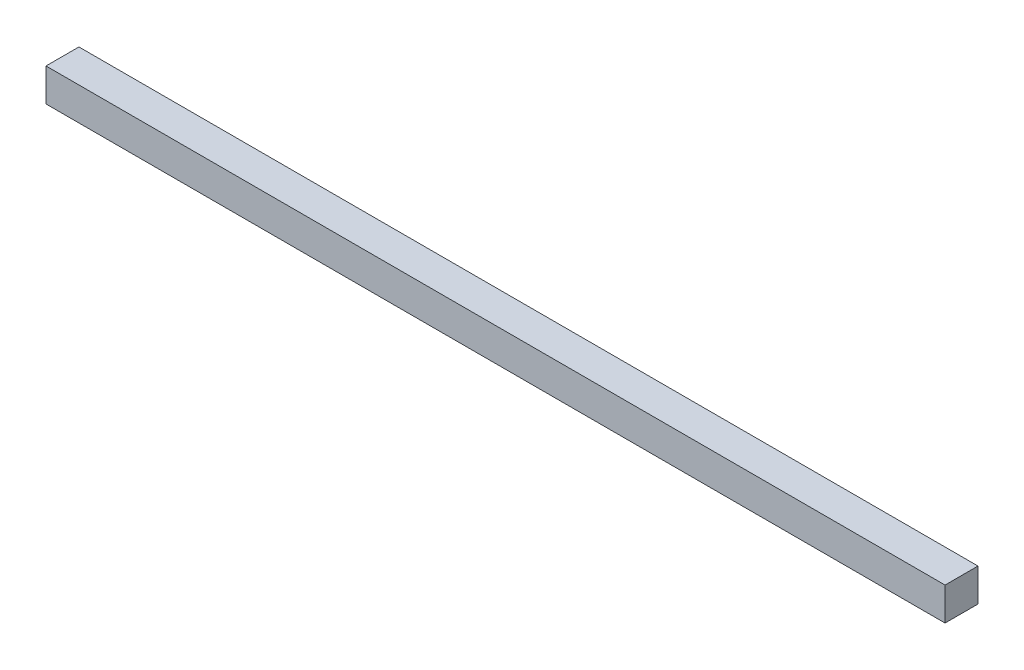
ISO-10303-21;
HEADER;
FILE_DESCRIPTION(('STEP AP214'),'2;1');
FILE_NAME('part.step','',(''),(''),'','','');
FILE_SCHEMA(('AUTOMOTIVE_DESIGN { 1 0 10303 214 1 1 1 1 }'));
ENDSEC;
DATA;
#1=APPLICATION_CONTEXT('core data for automotive mechanical design processes');
#2=APPLICATION_PROTOCOL_DEFINITION('international standard','automotive_design',2000,#1);
#3=PRODUCT_CONTEXT('',#1,'mechanical');
#4=PRODUCT('Part','Part','',(#3));
#5=PRODUCT_RELATED_PRODUCT_CATEGORY('part','',(#4));
#6=PRODUCT_DEFINITION_FORMATION('','',#4);
#7=PRODUCT_DEFINITION_CONTEXT('part definition',#1,'design');
#8=PRODUCT_DEFINITION('design','',#6,#7);
#9=PRODUCT_DEFINITION_SHAPE('','',#8);
#10=(LENGTH_UNIT() NAMED_UNIT(*) SI_UNIT(.MILLI.,.METRE.));
#11=(NAMED_UNIT(*) PLANE_ANGLE_UNIT() SI_UNIT($,.RADIAN.));
#12=(NAMED_UNIT(*) SI_UNIT($,.STERADIAN.) SOLID_ANGLE_UNIT());
#13=UNCERTAINTY_MEASURE_WITH_UNIT(LENGTH_MEASURE(1.E-05),#10,'distance_accuracy_value','');
#14=(GEOMETRIC_REPRESENTATION_CONTEXT(3) GLOBAL_UNCERTAINTY_ASSIGNED_CONTEXT((#13)) GLOBAL_UNIT_ASSIGNED_CONTEXT((#10,
#11,#12)) REPRESENTATION_CONTEXT('',''));
#15=CARTESIAN_POINT('',(0.,0.,0.));
#16=DIRECTION('',(0.,0.,1.));
#17=DIRECTION('',(1.,0.,0.));
#18=AXIS2_PLACEMENT_3D('',#15,#16,#17);
#19=CARTESIAN_POINT('',(-87.5927033492823,45.5454545454545,10.));
#20=DIRECTION('',(1.,0.,0.));
#21=DIRECTION('',(0.,0.,-1.));
#22=AXIS2_PLACEMENT_3D('',#19,#20,#21);
#23=PLANE('',#22);
#24=DIRECTION('',(0.,-1.,0.));
#25=VECTOR('',#24,1.);
#26=CARTESIAN_POINT('',(-87.5927033492823,45.5454545454545,0.));
#27=LINE('',#26,#25);
#28=CARTESIAN_POINT('',(-87.5927033492823,45.5454545454545,0.));
#29=VERTEX_POINT('',#28);
#30=CARTESIAN_POINT('',(-87.5927033492823,35.5454545454545,0.));
#31=VERTEX_POINT('',#30);
#32=EDGE_CURVE('E96',#29,#31,#27,.T.);
#33=ORIENTED_EDGE('',*,*,#32,.T.);
#34=DIRECTION('',(0.,0.,-1.));
#35=VECTOR('',#34,1.);
#36=CARTESIAN_POINT('',(-87.5927033492823,35.5454545454545,10.));
#37=LINE('',#36,#35);
#38=CARTESIAN_POINT('',(-87.5927033492823,35.5454545454545,10.));
#39=VERTEX_POINT('',#38);
#40=EDGE_CURVE('E11',#39,#31,#37,.T.);
#41=ORIENTED_EDGE('',*,*,#40,.F.);
#42=DIRECTION('',(0.,-1.,0.));
#43=VECTOR('',#42,1.);
#44=CARTESIAN_POINT('',(-87.5927033492823,45.5454545454545,10.));
#45=LINE('',#44,#43);
#46=CARTESIAN_POINT('',(-87.5927033492823,45.5454545454545,10.));
#47=VERTEX_POINT('',#46);
#48=EDGE_CURVE('E84',#47,#39,#45,.T.);
#49=ORIENTED_EDGE('',*,*,#48,.F.);
#50=DIRECTION('',(0.,0.,-1.));
#51=VECTOR('',#50,1.);
#52=CARTESIAN_POINT('',(-87.5927033492823,45.5454545454545,10.));
#53=LINE('',#52,#51);
#54=EDGE_CURVE('E92',#47,#29,#53,.T.);
#55=ORIENTED_EDGE('',*,*,#54,.T.);
#56=EDGE_LOOP('',(#33,#41,#49,#55));
#57=FACE_BOUND('',#56,.T.);
#58=ADVANCED_FACE('F33',(#57),#23,.F.);
#59=CARTESIAN_POINT('',(-87.5927033492823,35.5454545454545,10.));
#60=DIRECTION('',(0.,1.,0.));
#61=DIRECTION('',(0.,0.,1.));
#62=AXIS2_PLACEMENT_3D('',#59,#60,#61);
#63=PLANE('',#62);
#64=DIRECTION('',(1.,0.,0.));
#65=VECTOR('',#64,1.);
#66=CARTESIAN_POINT('',(-87.5927033492823,35.5454545454545,0.));
#67=LINE('',#66,#65);
#68=CARTESIAN_POINT('',(185.407296650718,35.5454545454545,0.));
#69=VERTEX_POINT('',#68);
#70=EDGE_CURVE('E88',#31,#69,#67,.T.);
#71=ORIENTED_EDGE('',*,*,#70,.T.);
#72=DIRECTION('',(0.,0.,-1.));
#73=VECTOR('',#72,1.);
#74=CARTESIAN_POINT('',(185.407296650718,35.5454545454545,10.));
#75=LINE('',#74,#73);
#76=CARTESIAN_POINT('',(185.407296650718,35.5454545454545,10.));
#77=VERTEX_POINT('',#76);
#78=EDGE_CURVE('E41',#77,#69,#75,.T.);
#79=ORIENTED_EDGE('',*,*,#78,.F.);
#80=DIRECTION('',(1.,0.,0.));
#81=VECTOR('',#80,1.);
#82=CARTESIAN_POINT('',(-87.5927033492823,35.5454545454545,10.));
#83=LINE('',#82,#81);
#84=EDGE_CURVE('E79',#39,#77,#83,.T.);
#85=ORIENTED_EDGE('',*,*,#84,.F.);
#86=ORIENTED_EDGE('',*,*,#40,.T.);
#87=EDGE_LOOP('',(#71,#79,#85,#86));
#88=FACE_BOUND('',#87,.T.);
#89=ADVANCED_FACE('F87',(#88),#63,.F.);
#90=CARTESIAN_POINT('',(185.407296650718,45.5454545454545,10.));
#91=DIRECTION('',(-1.,0.,0.));
#92=DIRECTION('',(0.,0.,1.));
#93=AXIS2_PLACEMENT_3D('',#90,#91,#92);
#94=PLANE('',#93);
#95=DIRECTION('',(0.,1.,0.));
#96=VECTOR('',#95,1.);
#97=CARTESIAN_POINT('',(185.407296650718,45.5454545454545,0.));
#98=LINE('',#97,#96);
#99=CARTESIAN_POINT('',(185.407296650718,45.5454545454545,0.));
#100=VERTEX_POINT('',#99);
#101=EDGE_CURVE('E66',#69,#100,#98,.T.);
#102=ORIENTED_EDGE('',*,*,#101,.T.);
#103=DIRECTION('',(0.,0.,-1.));
#104=VECTOR('',#103,1.);
#105=CARTESIAN_POINT('',(185.407296650718,45.5454545454545,10.));
#106=LINE('',#105,#104);
#107=CARTESIAN_POINT('',(185.407296650718,45.5454545454545,10.));
#108=VERTEX_POINT('',#107);
#109=EDGE_CURVE('E89',#108,#100,#106,.T.);
#110=ORIENTED_EDGE('',*,*,#109,.F.);
#111=DIRECTION('',(0.,1.,0.));
#112=VECTOR('',#111,1.);
#113=CARTESIAN_POINT('',(185.407296650718,45.5454545454545,10.));
#114=LINE('',#113,#112);
#115=EDGE_CURVE('E82',#77,#108,#114,.T.);
#116=ORIENTED_EDGE('',*,*,#115,.F.);
#117=ORIENTED_EDGE('',*,*,#78,.T.);
#118=EDGE_LOOP('',(#102,#110,#116,#117));
#119=FACE_BOUND('',#118,.T.);
#120=ADVANCED_FACE('F90',(#119),#94,.F.);
#121=CARTESIAN_POINT('',(-87.5927033492823,45.5454545454545,10.));
#122=DIRECTION('',(0.,-1.,0.));
#123=DIRECTION('',(0.,0.,-1.));
#124=AXIS2_PLACEMENT_3D('',#121,#122,#123);
#125=PLANE('',#124);
#126=DIRECTION('',(-1.,0.,0.));
#127=VECTOR('',#126,1.);
#128=CARTESIAN_POINT('',(-87.5927033492823,45.5454545454545,0.));
#129=LINE('',#128,#127);
#130=EDGE_CURVE('E72',#100,#29,#129,.T.);
#131=ORIENTED_EDGE('',*,*,#130,.T.);
#132=ORIENTED_EDGE('',*,*,#54,.F.);
#133=DIRECTION('',(-1.,0.,0.));
#134=VECTOR('',#133,1.);
#135=CARTESIAN_POINT('',(-87.5927033492823,45.5454545454545,10.));
#136=LINE('',#135,#134);
#137=EDGE_CURVE('E49',#108,#47,#136,.T.);
#138=ORIENTED_EDGE('',*,*,#137,.F.);
#139=ORIENTED_EDGE('',*,*,#109,.T.);
#140=EDGE_LOOP('',(#131,#132,#138,#139));
#141=FACE_BOUND('',#140,.T.);
#142=ADVANCED_FACE('F103',(#141),#125,.F.);
#143=CARTESIAN_POINT('',(0.,0.,10.));
#144=DIRECTION('',(0.,0.,1.));
#145=DIRECTION('',(1.,0.,0.));
#146=AXIS2_PLACEMENT_3D('',#143,#144,#145);
#147=PLANE('',#146);
#148=ORIENTED_EDGE('',*,*,#48,.T.);
#149=ORIENTED_EDGE('',*,*,#84,.T.);
#150=ORIENTED_EDGE('',*,*,#115,.T.);
#151=ORIENTED_EDGE('',*,*,#137,.T.);
#152=EDGE_LOOP('',(#148,#149,#150,#151));
#153=FACE_BOUND('',#152,.T.);
#154=ADVANCED_FACE('F80',(#153),#147,.T.);
#155=CARTESIAN_POINT('',(0.,0.,0.));
#156=DIRECTION('',(0.,0.,1.));
#157=DIRECTION('',(1.,0.,0.));
#158=AXIS2_PLACEMENT_3D('',#155,#156,#157);
#159=PLANE('',#158);
#160=ORIENTED_EDGE('',*,*,#32,.F.);
#161=ORIENTED_EDGE('',*,*,#130,.F.);
#162=ORIENTED_EDGE('',*,*,#101,.F.);
#163=ORIENTED_EDGE('',*,*,#70,.F.);
#164=EDGE_LOOP('',(#160,#161,#162,#163));
#165=FACE_BOUND('',#164,.T.);
#166=ADVANCED_FACE('F106',(#165),#159,.F.);
#167=CLOSED_SHELL('',(#58,#89,#120,#142,#154,#166));
#168=MANIFOLD_SOLID_BREP('B2',#167);
#169=ADVANCED_BREP_SHAPE_REPRESENTATION('',(#18,#168),#14);
#170=SHAPE_DEFINITION_REPRESENTATION(#9,#169);
ENDSEC;
END-ISO-10303-21;
